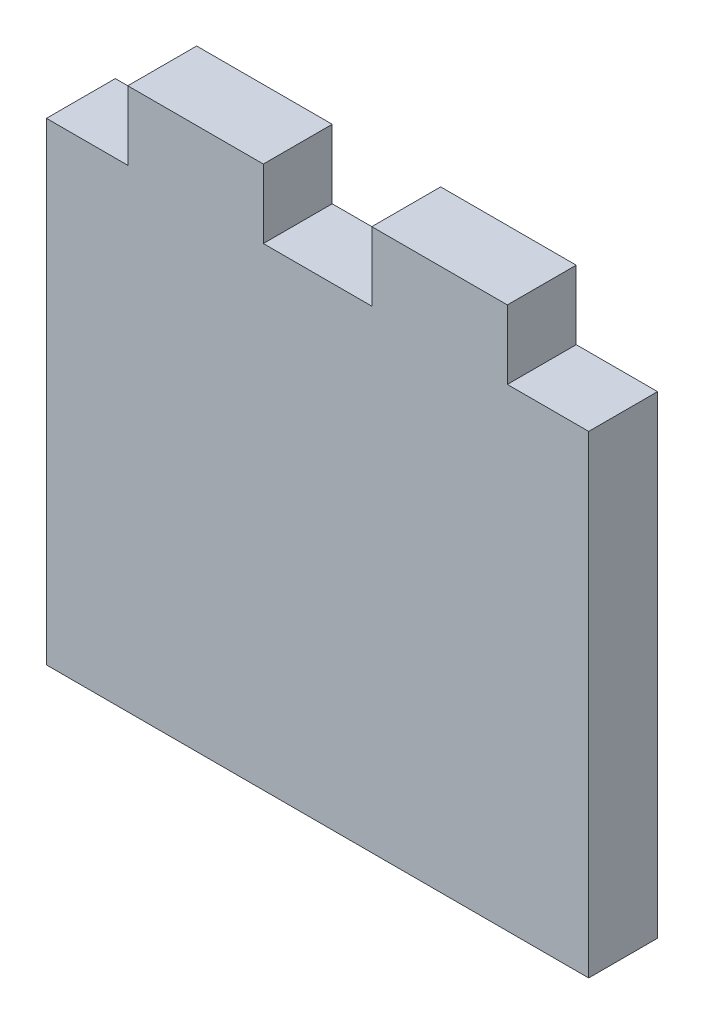
ISO-10303-21;
HEADER;
FILE_DESCRIPTION(('STEP AP214'),'2;1');
FILE_NAME('part.step','',(''),(''),'','','');
FILE_SCHEMA(('AUTOMOTIVE_DESIGN { 1 0 10303 214 1 1 1 1 }'));
ENDSEC;
DATA;
#1=APPLICATION_CONTEXT('core data for automotive mechanical design processes');
#2=APPLICATION_PROTOCOL_DEFINITION('international standard','automotive_design',2000,#1);
#3=PRODUCT_CONTEXT('',#1,'mechanical');
#4=PRODUCT('Part','Part','',(#3));
#5=PRODUCT_RELATED_PRODUCT_CATEGORY('part','',(#4));
#6=PRODUCT_DEFINITION_FORMATION('','',#4);
#7=PRODUCT_DEFINITION_CONTEXT('part definition',#1,'design');
#8=PRODUCT_DEFINITION('design','',#6,#7);
#9=PRODUCT_DEFINITION_SHAPE('','',#8);
#10=(LENGTH_UNIT() NAMED_UNIT(*) SI_UNIT(.MILLI.,.METRE.));
#11=(NAMED_UNIT(*) PLANE_ANGLE_UNIT() SI_UNIT($,.RADIAN.));
#12=(NAMED_UNIT(*) SI_UNIT($,.STERADIAN.) SOLID_ANGLE_UNIT());
#13=UNCERTAINTY_MEASURE_WITH_UNIT(LENGTH_MEASURE(1.E-05),#10,'distance_accuracy_value','');
#14=(GEOMETRIC_REPRESENTATION_CONTEXT(3) GLOBAL_UNCERTAINTY_ASSIGNED_CONTEXT((#13)) GLOBAL_UNIT_ASSIGNED_CONTEXT((#10,
#11,#12)) REPRESENTATION_CONTEXT('',''));
#15=CARTESIAN_POINT('',(0.,0.,0.));
#16=DIRECTION('',(0.,0.,1.));
#17=DIRECTION('',(1.,0.,0.));
#18=AXIS2_PLACEMENT_3D('',#15,#16,#17);
#19=CARTESIAN_POINT('',(0.,50.,6.35));
#20=DIRECTION('',(0.,-1.,0.));
#21=DIRECTION('',(0.,0.,-1.));
#22=AXIS2_PLACEMENT_3D('',#19,#20,#21);
#23=PLANE('',#22);
#24=DIRECTION('',(-1.,0.,0.));
#25=VECTOR('',#24,1.);
#26=CARTESIAN_POINT('',(0.,50.,0.));
#27=LINE('',#26,#25);
#28=CARTESIAN_POINT('',(20.,50.,0.));
#29=VERTEX_POINT('',#28);
#30=CARTESIAN_POINT('',(7.50000000000001,50.,0.));
#31=VERTEX_POINT('',#30);
#32=EDGE_CURVE('E149',#29,#31,#27,.T.);
#33=ORIENTED_EDGE('',*,*,#32,.T.);
#34=DIRECTION('',(0.,0.,1.));
#35=VECTOR('',#34,1.);
#36=CARTESIAN_POINT('',(7.50000000000001,50.,0.));
#37=LINE('',#36,#35);
#38=CARTESIAN_POINT('',(7.50000000000001,50.,6.35));
#39=VERTEX_POINT('',#38);
#40=EDGE_CURVE('E185',#31,#39,#37,.T.);
#41=ORIENTED_EDGE('',*,*,#40,.T.);
#42=DIRECTION('',(-1.,0.,0.));
#43=VECTOR('',#42,1.);
#44=CARTESIAN_POINT('',(0.,50.,6.35));
#45=LINE('',#44,#43);
#46=CARTESIAN_POINT('',(20.,50.,6.35));
#47=VERTEX_POINT('',#46);
#48=EDGE_CURVE('E163',#47,#39,#45,.T.);
#49=ORIENTED_EDGE('',*,*,#48,.F.);
#50=DIRECTION('',(0.,0.,1.));
#51=VECTOR('',#50,1.);
#52=CARTESIAN_POINT('',(20.,50.,0.));
#53=LINE('',#52,#51);
#54=EDGE_CURVE('E198',#29,#47,#53,.T.);
#55=ORIENTED_EDGE('',*,*,#54,.F.);
#56=EDGE_LOOP('',(#33,#41,#49,#55));
#57=FACE_BOUND('',#56,.T.);
#58=ADVANCED_FACE('F36',(#57),#23,.F.);
#59=CARTESIAN_POINT('',(0.,0.,6.35));
#60=DIRECTION('',(1.,0.,0.));
#61=DIRECTION('',(0.,1.,0.));
#62=AXIS2_PLACEMENT_3D('',#59,#60,#61);
#63=PLANE('',#62);
#64=DIRECTION('',(0.,-1.,0.));
#65=VECTOR('',#64,1.);
#66=CARTESIAN_POINT('',(0.,0.,6.35));
#67=LINE('',#66,#65);
#68=CARTESIAN_POINT('',(0.,43.65,6.35));
#69=VERTEX_POINT('',#68);
#70=CARTESIAN_POINT('',(0.,0.,6.35));
#71=VERTEX_POINT('',#70);
#72=EDGE_CURVE('E148',#69,#71,#67,.T.);
#73=ORIENTED_EDGE('',*,*,#72,.F.);
#74=DIRECTION('',(0.,0.,1.));
#75=VECTOR('',#74,1.);
#76=CARTESIAN_POINT('',(0.,43.65,0.));
#77=LINE('',#76,#75);
#78=CARTESIAN_POINT('',(0.,43.65,0.));
#79=VERTEX_POINT('',#78);
#80=EDGE_CURVE('E194',#79,#69,#77,.T.);
#81=ORIENTED_EDGE('',*,*,#80,.F.);
#82=DIRECTION('',(0.,-1.,0.));
#83=VECTOR('',#82,1.);
#84=CARTESIAN_POINT('',(0.,0.,0.));
#85=LINE('',#84,#83);
#86=CARTESIAN_POINT('',(0.,0.,0.));
#87=VERTEX_POINT('',#86);
#88=EDGE_CURVE('E172',#79,#87,#85,.T.);
#89=ORIENTED_EDGE('',*,*,#88,.T.);
#90=DIRECTION('',(0.,0.,-1.));
#91=VECTOR('',#90,1.);
#92=CARTESIAN_POINT('',(0.,0.,6.35));
#93=LINE('',#92,#91);
#94=EDGE_CURVE('E11',#71,#87,#93,.T.);
#95=ORIENTED_EDGE('',*,*,#94,.F.);
#96=EDGE_LOOP('',(#73,#81,#89,#95));
#97=FACE_BOUND('',#96,.T.);
#98=ADVANCED_FACE('F38',(#97),#63,.F.);
#99=CARTESIAN_POINT('',(0.,0.,6.35));
#100=DIRECTION('',(0.,1.,0.));
#101=DIRECTION('',(0.,0.,1.));
#102=AXIS2_PLACEMENT_3D('',#99,#100,#101);
#103=PLANE('',#102);
#104=DIRECTION('',(1.,0.,0.));
#105=VECTOR('',#104,1.);
#106=CARTESIAN_POINT('',(0.,0.,0.));
#107=LINE('',#106,#105);
#108=CARTESIAN_POINT('',(50.,0.,0.));
#109=VERTEX_POINT('',#108);
#110=EDGE_CURVE('E173',#87,#109,#107,.T.);
#111=ORIENTED_EDGE('',*,*,#110,.T.);
#112=DIRECTION('',(0.,0.,-1.));
#113=VECTOR('',#112,1.);
#114=CARTESIAN_POINT('',(50.,0.,6.35));
#115=LINE('',#114,#113);
#116=CARTESIAN_POINT('',(50.,0.,6.35));
#117=VERTEX_POINT('',#116);
#118=EDGE_CURVE('E44',#117,#109,#115,.T.);
#119=ORIENTED_EDGE('',*,*,#118,.F.);
#120=DIRECTION('',(1.,0.,0.));
#121=VECTOR('',#120,1.);
#122=CARTESIAN_POINT('',(0.,0.,6.35));
#123=LINE('',#122,#121);
#124=EDGE_CURVE('E151',#71,#117,#123,.T.);
#125=ORIENTED_EDGE('',*,*,#124,.F.);
#126=ORIENTED_EDGE('',*,*,#94,.T.);
#127=EDGE_LOOP('',(#111,#119,#125,#126));
#128=FACE_BOUND('',#127,.T.);
#129=ADVANCED_FACE('F246',(#128),#103,.F.);
#130=CARTESIAN_POINT('',(50.,0.,6.35));
#131=DIRECTION('',(-1.,0.,0.));
#132=DIRECTION('',(0.,-1.,0.));
#133=AXIS2_PLACEMENT_3D('',#130,#131,#132);
#134=PLANE('',#133);
#135=DIRECTION('',(0.,1.,0.));
#136=VECTOR('',#135,1.);
#137=CARTESIAN_POINT('',(50.,0.,0.));
#138=LINE('',#137,#136);
#139=CARTESIAN_POINT('',(50.,43.65,0.));
#140=VERTEX_POINT('',#139);
#141=EDGE_CURVE('E154',#109,#140,#138,.T.);
#142=ORIENTED_EDGE('',*,*,#141,.T.);
#143=DIRECTION('',(0.,0.,1.));
#144=VECTOR('',#143,1.);
#145=CARTESIAN_POINT('',(50.,43.65,0.));
#146=LINE('',#145,#144);
#147=CARTESIAN_POINT('',(50.,43.65,6.35));
#148=VERTEX_POINT('',#147);
#149=EDGE_CURVE('E174',#140,#148,#146,.T.);
#150=ORIENTED_EDGE('',*,*,#149,.T.);
#151=DIRECTION('',(0.,1.,0.));
#152=VECTOR('',#151,1.);
#153=CARTESIAN_POINT('',(50.,0.,6.35));
#154=LINE('',#153,#152);
#155=EDGE_CURVE('E168',#117,#148,#154,.T.);
#156=ORIENTED_EDGE('',*,*,#155,.F.);
#157=ORIENTED_EDGE('',*,*,#118,.T.);
#158=EDGE_LOOP('',(#142,#150,#156,#157));
#159=FACE_BOUND('',#158,.T.);
#160=ADVANCED_FACE('F178',(#159),#134,.F.);
#161=CARTESIAN_POINT('',(42.5,50.,6.35));
#162=VERTEX_POINT('',#161);
#163=CARTESIAN_POINT('',(30.,50.,6.35));
#164=VERTEX_POINT('',#163);
#165=EDGE_CURVE('E142',#162,#164,#45,.T.);
#166=ORIENTED_EDGE('',*,*,#165,.F.);
#167=DIRECTION('',(0.,0.,1.));
#168=VECTOR('',#167,1.);
#169=CARTESIAN_POINT('',(42.5,50.,0.));
#170=LINE('',#169,#168);
#171=CARTESIAN_POINT('',(42.5,50.,0.));
#172=VERTEX_POINT('',#171);
#173=EDGE_CURVE('E128',#172,#162,#170,.T.);
#174=ORIENTED_EDGE('',*,*,#173,.F.);
#175=CARTESIAN_POINT('',(30.,50.,0.));
#176=VERTEX_POINT('',#175);
#177=EDGE_CURVE('E140',#172,#176,#27,.T.);
#178=ORIENTED_EDGE('',*,*,#177,.T.);
#179=DIRECTION('',(0.,0.,1.));
#180=VECTOR('',#179,1.);
#181=CARTESIAN_POINT('',(30.,50.,0.));
#182=LINE('',#181,#180);
#183=EDGE_CURVE('E221',#176,#164,#182,.T.);
#184=ORIENTED_EDGE('',*,*,#183,.T.);
#185=EDGE_LOOP('',(#166,#174,#178,#184));
#186=FACE_BOUND('',#185,.T.);
#187=ADVANCED_FACE('F138',(#186),#23,.F.);
#188=CARTESIAN_POINT('',(0.,0.,6.35));
#189=DIRECTION('',(0.,0.,-1.));
#190=DIRECTION('',(-1.,0.,0.));
#191=AXIS2_PLACEMENT_3D('',#188,#189,#190);
#192=PLANE('',#191);
#193=ORIENTED_EDGE('',*,*,#155,.T.);
#194=DIRECTION('',(1.,0.,0.));
#195=VECTOR('',#194,1.);
#196=CARTESIAN_POINT('',(50.,43.65,6.35));
#197=LINE('',#196,#195);
#198=CARTESIAN_POINT('',(42.5,43.65,6.35));
#199=VERTEX_POINT('',#198);
#200=EDGE_CURVE('E133',#199,#148,#197,.T.);
#201=ORIENTED_EDGE('',*,*,#200,.F.);
#202=DIRECTION('',(0.,-1.,0.));
#203=VECTOR('',#202,1.);
#204=CARTESIAN_POINT('',(42.5,50.,6.35));
#205=LINE('',#204,#203);
#206=EDGE_CURVE('E183',#162,#199,#205,.T.);
#207=ORIENTED_EDGE('',*,*,#206,.F.);
#208=ORIENTED_EDGE('',*,*,#165,.T.);
#209=DIRECTION('',(0.,1.,0.));
#210=VECTOR('',#209,1.);
#211=CARTESIAN_POINT('',(30.,50.,6.35));
#212=LINE('',#211,#210);
#213=CARTESIAN_POINT('',(30.,43.65,6.35));
#214=VERTEX_POINT('',#213);
#215=EDGE_CURVE('E209',#214,#164,#212,.T.);
#216=ORIENTED_EDGE('',*,*,#215,.F.);
#217=DIRECTION('',(1.,0.,0.));
#218=VECTOR('',#217,1.);
#219=CARTESIAN_POINT('',(20.,43.65,6.35));
#220=LINE('',#219,#218);
#221=CARTESIAN_POINT('',(20.,43.65,6.35));
#222=VERTEX_POINT('',#221);
#223=EDGE_CURVE('E216',#222,#214,#220,.T.);
#224=ORIENTED_EDGE('',*,*,#223,.F.);
#225=DIRECTION('',(0.,-1.,0.));
#226=VECTOR('',#225,1.);
#227=CARTESIAN_POINT('',(20.,50.,6.35));
#228=LINE('',#227,#226);
#229=EDGE_CURVE('E213',#47,#222,#228,.T.);
#230=ORIENTED_EDGE('',*,*,#229,.F.);
#231=ORIENTED_EDGE('',*,*,#48,.T.);
#232=DIRECTION('',(0.,1.,0.));
#233=VECTOR('',#232,1.);
#234=CARTESIAN_POINT('',(7.50000000000001,50.,6.35));
#235=LINE('',#234,#233);
#236=CARTESIAN_POINT('',(7.50000000000001,43.65,6.35));
#237=VERTEX_POINT('',#236);
#238=EDGE_CURVE('E192',#237,#39,#235,.T.);
#239=ORIENTED_EDGE('',*,*,#238,.F.);
#240=DIRECTION('',(1.,0.,0.));
#241=VECTOR('',#240,1.);
#242=CARTESIAN_POINT('',(0.,43.65,6.35));
#243=LINE('',#242,#241);
#244=EDGE_CURVE('E195',#69,#237,#243,.T.);
#245=ORIENTED_EDGE('',*,*,#244,.F.);
#246=ORIENTED_EDGE('',*,*,#72,.T.);
#247=ORIENTED_EDGE('',*,*,#124,.T.);
#248=EDGE_LOOP('',(#193,#201,#207,#208,#216,#224,#230,#231,#239,#245,#246,#247));
#249=FACE_BOUND('',#248,.T.);
#250=ADVANCED_FACE('F227',(#249),#192,.F.);
#251=CARTESIAN_POINT('',(0.,0.,0.));
#252=DIRECTION('',(0.,0.,-1.));
#253=DIRECTION('',(-1.,0.,0.));
#254=AXIS2_PLACEMENT_3D('',#251,#252,#253);
#255=PLANE('',#254);
#256=DIRECTION('',(1.,0.,0.));
#257=VECTOR('',#256,1.);
#258=CARTESIAN_POINT('',(50.,43.65,0.));
#259=LINE('',#258,#257);
#260=CARTESIAN_POINT('',(42.5,43.65,0.));
#261=VERTEX_POINT('',#260);
#262=EDGE_CURVE('E51',#261,#140,#259,.T.);
#263=ORIENTED_EDGE('',*,*,#262,.T.);
#264=ORIENTED_EDGE('',*,*,#141,.F.);
#265=ORIENTED_EDGE('',*,*,#110,.F.);
#266=ORIENTED_EDGE('',*,*,#88,.F.);
#267=DIRECTION('',(1.,0.,0.));
#268=VECTOR('',#267,1.);
#269=CARTESIAN_POINT('',(0.,43.65,0.));
#270=LINE('',#269,#268);
#271=CARTESIAN_POINT('',(7.50000000000001,43.65,0.));
#272=VERTEX_POINT('',#271);
#273=EDGE_CURVE('E189',#79,#272,#270,.T.);
#274=ORIENTED_EDGE('',*,*,#273,.T.);
#275=DIRECTION('',(0.,1.,0.));
#276=VECTOR('',#275,1.);
#277=CARTESIAN_POINT('',(7.50000000000001,50.,0.));
#278=LINE('',#277,#276);
#279=EDGE_CURVE('E59',#272,#31,#278,.T.);
#280=ORIENTED_EDGE('',*,*,#279,.T.);
#281=ORIENTED_EDGE('',*,*,#32,.F.);
#282=DIRECTION('',(0.,-1.,0.));
#283=VECTOR('',#282,1.);
#284=CARTESIAN_POINT('',(20.,50.,0.));
#285=LINE('',#284,#283);
#286=CARTESIAN_POINT('',(20.,43.65,0.));
#287=VERTEX_POINT('',#286);
#288=EDGE_CURVE('E205',#29,#287,#285,.T.);
#289=ORIENTED_EDGE('',*,*,#288,.T.);
#290=DIRECTION('',(1.,0.,0.));
#291=VECTOR('',#290,1.);
#292=CARTESIAN_POINT('',(20.,43.65,0.));
#293=LINE('',#292,#291);
#294=CARTESIAN_POINT('',(30.,43.65,0.));
#295=VERTEX_POINT('',#294);
#296=EDGE_CURVE('E208',#287,#295,#293,.T.);
#297=ORIENTED_EDGE('',*,*,#296,.T.);
#298=DIRECTION('',(0.,1.,0.));
#299=VECTOR('',#298,1.);
#300=CARTESIAN_POINT('',(30.,50.,0.));
#301=LINE('',#300,#299);
#302=EDGE_CURVE('E147',#295,#176,#301,.T.);
#303=ORIENTED_EDGE('',*,*,#302,.T.);
#304=ORIENTED_EDGE('',*,*,#177,.F.);
#305=DIRECTION('',(0.,-1.,0.));
#306=VECTOR('',#305,1.);
#307=CARTESIAN_POINT('',(42.5,50.,0.));
#308=LINE('',#307,#306);
#309=EDGE_CURVE('E124',#172,#261,#308,.T.);
#310=ORIENTED_EDGE('',*,*,#309,.T.);
#311=EDGE_LOOP('',(#263,#264,#265,#266,#274,#280,#281,#289,#297,#303,#304,#310));
#312=FACE_BOUND('',#311,.T.);
#313=ADVANCED_FACE('F145',(#312),#255,.T.);
#314=CARTESIAN_POINT('',(20.,50.,0.));
#315=DIRECTION('',(-1.,0.,0.));
#316=DIRECTION('',(0.,0.,1.));
#317=AXIS2_PLACEMENT_3D('',#314,#315,#316);
#318=PLANE('',#317);
#319=ORIENTED_EDGE('',*,*,#229,.T.);
#320=DIRECTION('',(0.,0.,1.));
#321=VECTOR('',#320,1.);
#322=CARTESIAN_POINT('',(20.,43.65,0.));
#323=LINE('',#322,#321);
#324=EDGE_CURVE('E212',#287,#222,#323,.T.);
#325=ORIENTED_EDGE('',*,*,#324,.F.);
#326=ORIENTED_EDGE('',*,*,#288,.F.);
#327=ORIENTED_EDGE('',*,*,#54,.T.);
#328=EDGE_LOOP('',(#319,#325,#326,#327));
#329=FACE_BOUND('',#328,.T.);
#330=ADVANCED_FACE('F290',(#329),#318,.F.);
#331=CARTESIAN_POINT('',(30.,50.,0.));
#332=DIRECTION('',(1.,0.,0.));
#333=DIRECTION('',(0.,0.,-1.));
#334=AXIS2_PLACEMENT_3D('',#331,#332,#333);
#335=PLANE('',#334);
#336=ORIENTED_EDGE('',*,*,#215,.T.);
#337=ORIENTED_EDGE('',*,*,#183,.F.);
#338=ORIENTED_EDGE('',*,*,#302,.F.);
#339=DIRECTION('',(0.,0.,1.));
#340=VECTOR('',#339,1.);
#341=CARTESIAN_POINT('',(30.,43.65,0.));
#342=LINE('',#341,#340);
#343=EDGE_CURVE('E223',#295,#214,#342,.T.);
#344=ORIENTED_EDGE('',*,*,#343,.T.);
#345=EDGE_LOOP('',(#336,#337,#338,#344));
#346=FACE_BOUND('',#345,.T.);
#347=ADVANCED_FACE('F298',(#346),#335,.F.);
#348=CARTESIAN_POINT('',(20.,43.65,0.));
#349=DIRECTION('',(0.,-1.,0.));
#350=DIRECTION('',(0.,0.,-1.));
#351=AXIS2_PLACEMENT_3D('',#348,#349,#350);
#352=PLANE('',#351);
#353=ORIENTED_EDGE('',*,*,#223,.T.);
#354=ORIENTED_EDGE('',*,*,#343,.F.);
#355=ORIENTED_EDGE('',*,*,#296,.F.);
#356=ORIENTED_EDGE('',*,*,#324,.T.);
#357=EDGE_LOOP('',(#353,#354,#355,#356));
#358=FACE_BOUND('',#357,.T.);
#359=ADVANCED_FACE('F308',(#358),#352,.F.);
#360=CARTESIAN_POINT('',(7.50000000000001,50.,0.));
#361=DIRECTION('',(1.,0.,0.));
#362=DIRECTION('',(0.,1.,0.));
#363=AXIS2_PLACEMENT_3D('',#360,#361,#362);
#364=PLANE('',#363);
#365=ORIENTED_EDGE('',*,*,#238,.T.);
#366=ORIENTED_EDGE('',*,*,#40,.F.);
#367=ORIENTED_EDGE('',*,*,#279,.F.);
#368=DIRECTION('',(0.,0.,1.));
#369=VECTOR('',#368,1.);
#370=CARTESIAN_POINT('',(7.50000000000001,43.65,0.));
#371=LINE('',#370,#369);
#372=EDGE_CURVE('E202',#272,#237,#371,.T.);
#373=ORIENTED_EDGE('',*,*,#372,.T.);
#374=EDGE_LOOP('',(#365,#366,#367,#373));
#375=FACE_BOUND('',#374,.T.);
#376=ADVANCED_FACE('F237',(#375),#364,.F.);
#377=CARTESIAN_POINT('',(0.,43.65,0.));
#378=DIRECTION('',(0.,-1.,0.));
#379=DIRECTION('',(0.,0.,-1.));
#380=AXIS2_PLACEMENT_3D('',#377,#378,#379);
#381=PLANE('',#380);
#382=ORIENTED_EDGE('',*,*,#244,.T.);
#383=ORIENTED_EDGE('',*,*,#372,.F.);
#384=ORIENTED_EDGE('',*,*,#273,.F.);
#385=ORIENTED_EDGE('',*,*,#80,.T.);
#386=EDGE_LOOP('',(#382,#383,#384,#385));
#387=FACE_BOUND('',#386,.T.);
#388=ADVANCED_FACE('F230',(#387),#381,.F.);
#389=CARTESIAN_POINT('',(50.,43.65,0.));
#390=DIRECTION('',(0.,-1.,0.));
#391=DIRECTION('',(1.,0.,0.));
#392=AXIS2_PLACEMENT_3D('',#389,#390,#391);
#393=PLANE('',#392);
#394=ORIENTED_EDGE('',*,*,#200,.T.);
#395=ORIENTED_EDGE('',*,*,#149,.F.);
#396=ORIENTED_EDGE('',*,*,#262,.F.);
#397=DIRECTION('',(0.,0.,1.));
#398=VECTOR('',#397,1.);
#399=CARTESIAN_POINT('',(42.5,43.65,0.));
#400=LINE('',#399,#398);
#401=EDGE_CURVE('E130',#261,#199,#400,.T.);
#402=ORIENTED_EDGE('',*,*,#401,.T.);
#403=EDGE_LOOP('',(#394,#395,#396,#402));
#404=FACE_BOUND('',#403,.T.);
#405=ADVANCED_FACE('F228',(#404),#393,.F.);
#406=CARTESIAN_POINT('',(42.5,50.,0.));
#407=DIRECTION('',(-1.,0.,0.));
#408=DIRECTION('',(0.,-1.,0.));
#409=AXIS2_PLACEMENT_3D('',#406,#407,#408);
#410=PLANE('',#409);
#411=ORIENTED_EDGE('',*,*,#206,.T.);
#412=ORIENTED_EDGE('',*,*,#401,.F.);
#413=ORIENTED_EDGE('',*,*,#309,.F.);
#414=ORIENTED_EDGE('',*,*,#173,.T.);
#415=EDGE_LOOP('',(#411,#412,#413,#414));
#416=FACE_BOUND('',#415,.T.);
#417=ADVANCED_FACE('F127',(#416),#410,.F.);
#418=CLOSED_SHELL('',(#58,#98,#129,#160,#187,#250,#313,#330,#347,#359,#376,#388,#405,#417));
#419=MANIFOLD_SOLID_BREP('B2',#418);
#420=ADVANCED_BREP_SHAPE_REPRESENTATION('',(#18,#419),#14);
#421=SHAPE_DEFINITION_REPRESENTATION(#9,#420);
ENDSEC;
END-ISO-10303-21;
